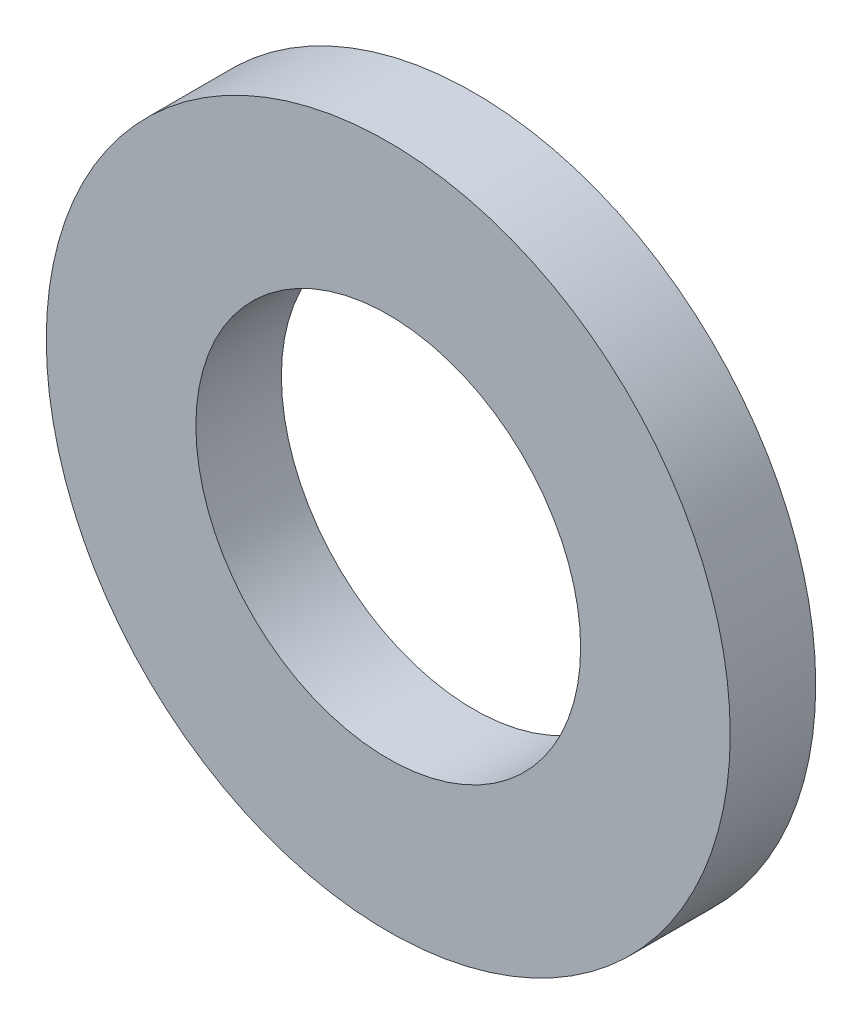
ISO-10303-21;
HEADER;
FILE_DESCRIPTION(('STEP AP214'),'2;1');
FILE_NAME('part.step','',(''),(''),'','','');
FILE_SCHEMA(('AUTOMOTIVE_DESIGN { 1 0 10303 214 1 1 1 1 }'));
ENDSEC;
DATA;
#1=APPLICATION_CONTEXT('core data for automotive mechanical design processes');
#2=APPLICATION_PROTOCOL_DEFINITION('international standard','automotive_design',2000,#1);
#3=PRODUCT_CONTEXT('',#1,'mechanical');
#4=PRODUCT('Part','Part','',(#3));
#5=PRODUCT_RELATED_PRODUCT_CATEGORY('part','',(#4));
#6=PRODUCT_DEFINITION_FORMATION('','',#4);
#7=PRODUCT_DEFINITION_CONTEXT('part definition',#1,'design');
#8=PRODUCT_DEFINITION('design','',#6,#7);
#9=PRODUCT_DEFINITION_SHAPE('','',#8);
#10=(LENGTH_UNIT() NAMED_UNIT(*) SI_UNIT(.MILLI.,.METRE.));
#11=(NAMED_UNIT(*) PLANE_ANGLE_UNIT() SI_UNIT($,.RADIAN.));
#12=(NAMED_UNIT(*) SI_UNIT($,.STERADIAN.) SOLID_ANGLE_UNIT());
#13=UNCERTAINTY_MEASURE_WITH_UNIT(LENGTH_MEASURE(1.E-05),#10,'distance_accuracy_value','');
#14=(GEOMETRIC_REPRESENTATION_CONTEXT(3) GLOBAL_UNCERTAINTY_ASSIGNED_CONTEXT((#13)) GLOBAL_UNIT_ASSIGNED_CONTEXT((#10,
#11,#12)) REPRESENTATION_CONTEXT('',''));
#15=CARTESIAN_POINT('',(0.,0.,0.));
#16=DIRECTION('',(0.,0.,1.));
#17=DIRECTION('',(1.,0.,0.));
#18=AXIS2_PLACEMENT_3D('',#15,#16,#17);
#19=CARTESIAN_POINT('',(0.,0.,1.));
#20=DIRECTION('',(0.,0.,1.));
#21=DIRECTION('',(1.,0.,0.));
#22=AXIS2_PLACEMENT_3D('',#19,#20,#21);
#23=PLANE('',#22);
#24=CARTESIAN_POINT('',(0.,0.,1.));
#25=DIRECTION('',(0.,0.,1.));
#26=DIRECTION('',(1.,0.,0.));
#27=AXIS2_PLACEMENT_3D('',#24,#25,#26);
#28=CIRCLE('',#27,4.);
#29=CARTESIAN_POINT('',(4.,0.,1.));
#30=VERTEX_POINT('',#29);
#31=EDGE_CURVE('E10',#30,#30,#28,.T.);
#32=ORIENTED_EDGE('',*,*,#31,.T.);
#33=EDGE_LOOP('',(#32));
#34=FACE_BOUND('',#33,.T.);
#35=CARTESIAN_POINT('',(0.,0.,1.));
#36=DIRECTION('',(0.,0.,1.));
#37=DIRECTION('',(1.,0.,0.));
#38=AXIS2_PLACEMENT_3D('',#35,#36,#37);
#39=CIRCLE('',#38,2.25);
#40=CARTESIAN_POINT('',(2.25,0.,1.));
#41=VERTEX_POINT('',#40);
#42=EDGE_CURVE('E50',#41,#41,#39,.T.);
#43=ORIENTED_EDGE('',*,*,#42,.F.);
#44=EDGE_LOOP('',(#43));
#45=FACE_BOUND('',#44,.T.);
#46=ADVANCED_FACE('F37',(#34,#45),#23,.T.);
#47=CARTESIAN_POINT('',(0.,0.,0.));
#48=DIRECTION('',(0.,0.,1.));
#49=DIRECTION('',(1.,0.,0.));
#50=AXIS2_PLACEMENT_3D('',#47,#48,#49);
#51=PLANE('',#50);
#52=CARTESIAN_POINT('',(0.,0.,0.));
#53=DIRECTION('',(0.,0.,1.));
#54=DIRECTION('',(1.,0.,0.));
#55=AXIS2_PLACEMENT_3D('',#52,#53,#54);
#56=CIRCLE('',#55,4.);
#57=CARTESIAN_POINT('',(4.,0.,0.));
#58=VERTEX_POINT('',#57);
#59=EDGE_CURVE('E41',#58,#58,#56,.T.);
#60=ORIENTED_EDGE('',*,*,#59,.F.);
#61=EDGE_LOOP('',(#60));
#62=FACE_BOUND('',#61,.T.);
#63=CARTESIAN_POINT('',(0.,0.,0.));
#64=DIRECTION('',(0.,0.,1.));
#65=DIRECTION('',(1.,0.,0.));
#66=AXIS2_PLACEMENT_3D('',#63,#64,#65);
#67=CIRCLE('',#66,2.25);
#68=CARTESIAN_POINT('',(2.25,0.,0.));
#69=VERTEX_POINT('',#68);
#70=EDGE_CURVE('E52',#69,#69,#67,.T.);
#71=ORIENTED_EDGE('',*,*,#70,.T.);
#72=EDGE_LOOP('',(#71));
#73=FACE_BOUND('',#72,.T.);
#74=ADVANCED_FACE('F64',(#62,#73),#51,.F.);
#75=CARTESIAN_POINT('',(0.,0.,1.));
#76=DIRECTION('',(0.,0.,-1.));
#77=DIRECTION('',(-1.,0.,0.));
#78=AXIS2_PLACEMENT_3D('',#75,#76,#77);
#79=CYLINDRICAL_SURFACE('',#78,4.);
#80=ORIENTED_EDGE('',*,*,#31,.F.);
#81=EDGE_LOOP('',(#80));
#82=FACE_BOUND('',#81,.T.);
#83=ORIENTED_EDGE('',*,*,#59,.T.);
#84=EDGE_LOOP('',(#83));
#85=FACE_BOUND('',#84,.T.);
#86=ADVANCED_FACE('F39',(#82,#85),#79,.T.);
#87=CARTESIAN_POINT('',(0.,0.,1.));
#88=DIRECTION('',(0.,0.,-1.));
#89=DIRECTION('',(-1.,0.,0.));
#90=AXIS2_PLACEMENT_3D('',#87,#88,#89);
#91=CYLINDRICAL_SURFACE('',#90,2.25);
#92=ORIENTED_EDGE('',*,*,#42,.T.);
#93=EDGE_LOOP('',(#92));
#94=FACE_BOUND('',#93,.T.);
#95=ORIENTED_EDGE('',*,*,#70,.F.);
#96=EDGE_LOOP('',(#95));
#97=FACE_BOUND('',#96,.T.);
#98=ADVANCED_FACE('F60',(#94,#97),#91,.F.);
#99=CLOSED_SHELL('',(#46,#74,#86,#98));
#100=MANIFOLD_SOLID_BREP('B2',#99);
#101=ADVANCED_BREP_SHAPE_REPRESENTATION('',(#18,#100),#14);
#102=SHAPE_DEFINITION_REPRESENTATION(#9,#101);
ENDSEC;
END-ISO-10303-21;
